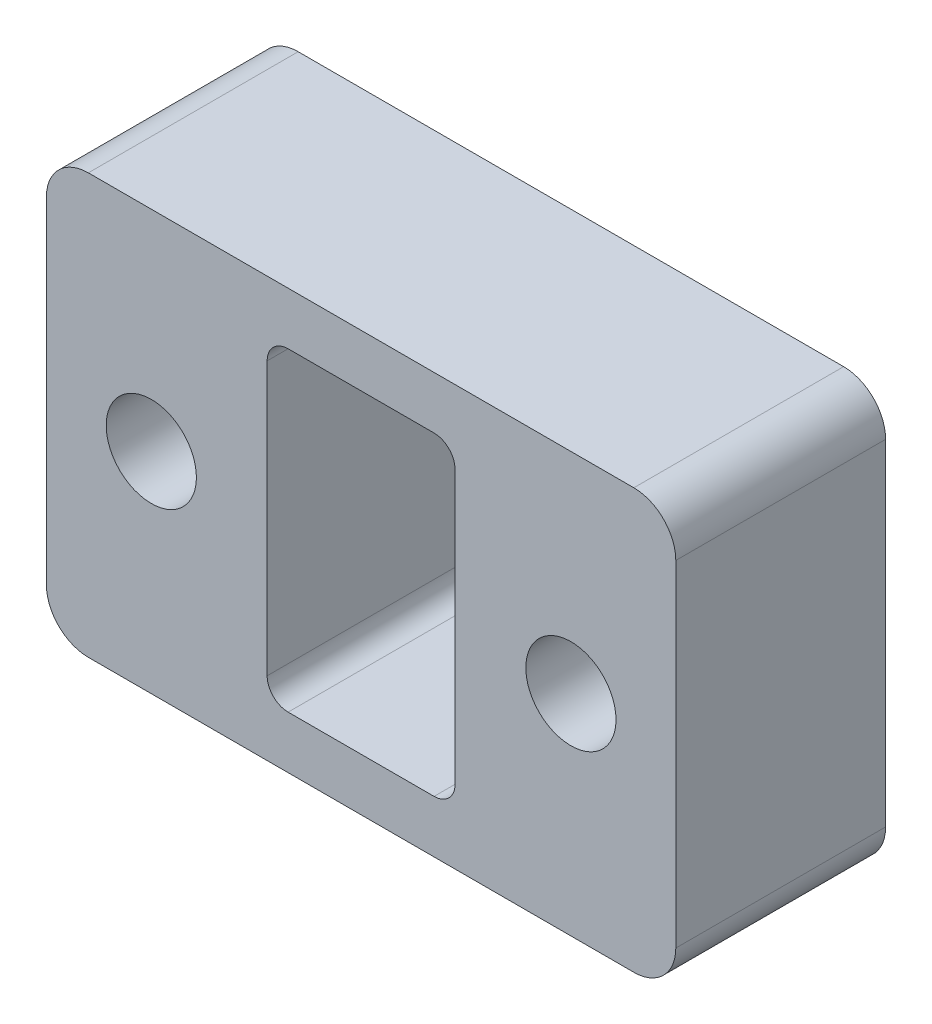
ISO-10303-21;
HEADER;
FILE_DESCRIPTION(('STEP AP214'),'2;1');
FILE_NAME('part.step','',(''),(''),'','','');
FILE_SCHEMA(('AUTOMOTIVE_DESIGN { 1 0 10303 214 1 1 1 1 }'));
ENDSEC;
DATA;
#1=APPLICATION_CONTEXT('core data for automotive mechanical design processes');
#2=APPLICATION_PROTOCOL_DEFINITION('international standard','automotive_design',2000,#1);
#3=PRODUCT_CONTEXT('',#1,'mechanical');
#4=PRODUCT('Part','Part','',(#3));
#5=PRODUCT_RELATED_PRODUCT_CATEGORY('part','',(#4));
#6=PRODUCT_DEFINITION_FORMATION('','',#4);
#7=PRODUCT_DEFINITION_CONTEXT('part definition',#1,'design');
#8=PRODUCT_DEFINITION('design','',#6,#7);
#9=PRODUCT_DEFINITION_SHAPE('','',#8);
#10=(LENGTH_UNIT() NAMED_UNIT(*) SI_UNIT(.MILLI.,.METRE.));
#11=(NAMED_UNIT(*) PLANE_ANGLE_UNIT() SI_UNIT($,.RADIAN.));
#12=(NAMED_UNIT(*) SI_UNIT($,.STERADIAN.) SOLID_ANGLE_UNIT());
#13=UNCERTAINTY_MEASURE_WITH_UNIT(LENGTH_MEASURE(1.E-05),#10,'distance_accuracy_value','');
#14=(GEOMETRIC_REPRESENTATION_CONTEXT(3) GLOBAL_UNCERTAINTY_ASSIGNED_CONTEXT((#13)) GLOBAL_UNIT_ASSIGNED_CONTEXT((#10,
#11,#12)) REPRESENTATION_CONTEXT('',''));
#15=CARTESIAN_POINT('',(0.,0.,0.));
#16=DIRECTION('',(0.,0.,1.));
#17=DIRECTION('',(1.,0.,0.));
#18=AXIS2_PLACEMENT_3D('',#15,#16,#17);
#19=CARTESIAN_POINT('',(0.,0.,10.));
#20=DIRECTION('',(0.,0.,-1.));
#21=DIRECTION('',(-1.,0.,0.));
#22=AXIS2_PLACEMENT_3D('',#19,#20,#21);
#23=PLANE('',#22);
#24=CARTESIAN_POINT('',(9.99999999999999,0.,10.));
#25=DIRECTION('',(0.,0.,1.));
#26=DIRECTION('',(1.,0.,0.));
#27=AXIS2_PLACEMENT_3D('',#24,#25,#26);
#28=CIRCLE('',#27,2.15);
#29=CARTESIAN_POINT('',(12.15,0.,10.));
#30=VERTEX_POINT('',#29);
#31=EDGE_CURVE('E270',#30,#30,#28,.T.);
#32=ORIENTED_EDGE('',*,*,#31,.F.);
#33=EDGE_LOOP('',(#32));
#34=FACE_BOUND('',#33,.T.);
#35=CARTESIAN_POINT('',(-10.,0.,10.));
#36=DIRECTION('',(0.,0.,1.));
#37=DIRECTION('',(1.,0.,0.));
#38=AXIS2_PLACEMENT_3D('',#35,#36,#37);
#39=CIRCLE('',#38,2.15);
#40=CARTESIAN_POINT('',(-7.85,0.,10.));
#41=VERTEX_POINT('',#40);
#42=EDGE_CURVE('E259',#41,#41,#39,.T.);
#43=ORIENTED_EDGE('',*,*,#42,.F.);
#44=EDGE_LOOP('',(#43));
#45=FACE_BOUND('',#44,.T.);
#46=DIRECTION('',(1.,0.,0.));
#47=VECTOR('',#46,1.);
#48=CARTESIAN_POINT('',(-15.,-9.99999999999999,10.));
#49=LINE('',#48,#47);
#50=CARTESIAN_POINT('',(-13.,-9.99999999999999,10.));
#51=VERTEX_POINT('',#50);
#52=CARTESIAN_POINT('',(13.,-9.99999999999999,10.));
#53=VERTEX_POINT('',#52);
#54=EDGE_CURVE('E175',#51,#53,#49,.T.);
#55=ORIENTED_EDGE('',*,*,#54,.T.);
#56=CARTESIAN_POINT('',(13.,-7.99999999999999,10.));
#57=DIRECTION('',(0.,0.,-1.));
#58=DIRECTION('',(-1.,0.,0.));
#59=AXIS2_PLACEMENT_3D('',#56,#57,#58);
#60=CIRCLE('',#59,2.);
#61=CARTESIAN_POINT('',(15.,-7.99999999999999,10.));
#62=VERTEX_POINT('',#61);
#63=EDGE_CURVE('E234',#53,#62,#60,.F.);
#64=ORIENTED_EDGE('',*,*,#63,.T.);
#65=DIRECTION('',(0.,1.,0.));
#66=VECTOR('',#65,1.);
#67=CARTESIAN_POINT('',(15.,-9.99999999999999,10.));
#68=LINE('',#67,#66);
#69=CARTESIAN_POINT('',(15.,8.00000000000001,10.));
#70=VERTEX_POINT('',#69);
#71=EDGE_CURVE('E264',#62,#70,#68,.T.);
#72=ORIENTED_EDGE('',*,*,#71,.T.);
#73=CARTESIAN_POINT('',(13.,8.00000000000001,10.));
#74=DIRECTION('',(0.,0.,-1.));
#75=DIRECTION('',(-1.,0.,0.));
#76=AXIS2_PLACEMENT_3D('',#73,#74,#75);
#77=CIRCLE('',#76,2.);
#78=CARTESIAN_POINT('',(13.,10.,10.));
#79=VERTEX_POINT('',#78);
#80=EDGE_CURVE('E229',#70,#79,#77,.F.);
#81=ORIENTED_EDGE('',*,*,#80,.T.);
#82=DIRECTION('',(-1.,0.,0.));
#83=VECTOR('',#82,1.);
#84=CARTESIAN_POINT('',(-15.,10.,10.));
#85=LINE('',#84,#83);
#86=CARTESIAN_POINT('',(-13.,10.,10.));
#87=VERTEX_POINT('',#86);
#88=EDGE_CURVE('E248',#79,#87,#85,.T.);
#89=ORIENTED_EDGE('',*,*,#88,.T.);
#90=CARTESIAN_POINT('',(-13.,8.00000000000001,10.));
#91=DIRECTION('',(0.,0.,-1.));
#92=DIRECTION('',(-1.,0.,0.));
#93=AXIS2_PLACEMENT_3D('',#90,#91,#92);
#94=CIRCLE('',#93,2.);
#95=CARTESIAN_POINT('',(-15.,8.00000000000001,10.));
#96=VERTEX_POINT('',#95);
#97=EDGE_CURVE('E57',#87,#96,#94,.F.);
#98=ORIENTED_EDGE('',*,*,#97,.T.);
#99=DIRECTION('',(0.,-1.,0.));
#100=VECTOR('',#99,1.);
#101=CARTESIAN_POINT('',(-15.,-9.99999999999999,10.));
#102=LINE('',#101,#100);
#103=CARTESIAN_POINT('',(-15.,-7.99999999999999,10.));
#104=VERTEX_POINT('',#103);
#105=EDGE_CURVE('E180',#96,#104,#102,.T.);
#106=ORIENTED_EDGE('',*,*,#105,.T.);
#107=CARTESIAN_POINT('',(-13.,-7.99999999999999,10.));
#108=DIRECTION('',(0.,0.,-1.));
#109=DIRECTION('',(-1.,0.,0.));
#110=AXIS2_PLACEMENT_3D('',#107,#108,#109);
#111=CIRCLE('',#110,2.);
#112=EDGE_CURVE('E232',#104,#51,#111,.F.);
#113=ORIENTED_EDGE('',*,*,#112,.T.);
#114=EDGE_LOOP('',(#55,#64,#72,#81,#89,#98,#106,#113));
#115=FACE_BOUND('',#114,.T.);
#116=DIRECTION('',(0.,1.,0.));
#117=VECTOR('',#116,1.);
#118=CARTESIAN_POINT('',(4.47816335794328,-7.5,10.));
#119=LINE('',#118,#117);
#120=CARTESIAN_POINT('',(4.47816335794328,-6.5,10.));
#121=VERTEX_POINT('',#120);
#122=CARTESIAN_POINT('',(4.47816335794328,6.50000000000001,10.));
#123=VERTEX_POINT('',#122);
#124=EDGE_CURVE('E280',#121,#123,#119,.T.);
#125=ORIENTED_EDGE('',*,*,#124,.F.);
#126=CARTESIAN_POINT('',(3.47816335794328,-6.5,10.));
#127=DIRECTION('',(0.,0.,-1.));
#128=DIRECTION('',(-1.,0.,0.));
#129=AXIS2_PLACEMENT_3D('',#126,#127,#128);
#130=CIRCLE('',#129,1.);
#131=CARTESIAN_POINT('',(3.47816335794328,-7.5,10.));
#132=VERTEX_POINT('',#131);
#133=EDGE_CURVE('E160',#121,#132,#130,.T.);
#134=ORIENTED_EDGE('',*,*,#133,.T.);
#135=DIRECTION('',(1.,0.,0.));
#136=VECTOR('',#135,1.);
#137=CARTESIAN_POINT('',(-4.47816335794328,-7.5,10.));
#138=LINE('',#137,#136);
#139=CARTESIAN_POINT('',(-3.47816335794328,-7.5,10.));
#140=VERTEX_POINT('',#139);
#141=EDGE_CURVE('E276',#140,#132,#138,.T.);
#142=ORIENTED_EDGE('',*,*,#141,.F.);
#143=CARTESIAN_POINT('',(-3.47816335794328,-6.5,10.));
#144=DIRECTION('',(0.,0.,-1.));
#145=DIRECTION('',(-1.,0.,0.));
#146=AXIS2_PLACEMENT_3D('',#143,#144,#145);
#147=CIRCLE('',#146,1.);
#148=CARTESIAN_POINT('',(-4.47816335794328,-6.5,10.));
#149=VERTEX_POINT('',#148);
#150=EDGE_CURVE('E161',#140,#149,#147,.T.);
#151=ORIENTED_EDGE('',*,*,#150,.T.);
#152=DIRECTION('',(0.,-1.,0.));
#153=VECTOR('',#152,1.);
#154=CARTESIAN_POINT('',(-4.47816335794328,-7.5,10.));
#155=LINE('',#154,#153);
#156=CARTESIAN_POINT('',(-4.47816335794328,6.50000000000001,10.));
#157=VERTEX_POINT('',#156);
#158=EDGE_CURVE('E287',#157,#149,#155,.T.);
#159=ORIENTED_EDGE('',*,*,#158,.F.);
#160=CARTESIAN_POINT('',(-3.47816335794328,6.50000000000001,10.));
#161=DIRECTION('',(0.,0.,-1.));
#162=DIRECTION('',(-1.,0.,0.));
#163=AXIS2_PLACEMENT_3D('',#160,#161,#162);
#164=CIRCLE('',#163,1.);
#165=CARTESIAN_POINT('',(-3.47816335794328,7.50000000000001,10.));
#166=VERTEX_POINT('',#165);
#167=EDGE_CURVE('E209',#157,#166,#164,.T.);
#168=ORIENTED_EDGE('',*,*,#167,.T.);
#169=DIRECTION('',(-1.,0.,0.));
#170=VECTOR('',#169,1.);
#171=CARTESIAN_POINT('',(-4.47816335794328,7.50000000000001,10.));
#172=LINE('',#171,#170);
#173=CARTESIAN_POINT('',(3.47816335794328,7.50000000000001,10.));
#174=VERTEX_POINT('',#173);
#175=EDGE_CURVE('E290',#174,#166,#172,.T.);
#176=ORIENTED_EDGE('',*,*,#175,.F.);
#177=CARTESIAN_POINT('',(3.47816335794328,6.50000000000001,10.));
#178=DIRECTION('',(0.,0.,-1.));
#179=DIRECTION('',(-1.,0.,0.));
#180=AXIS2_PLACEMENT_3D('',#177,#178,#179);
#181=CIRCLE('',#180,1.);
#182=EDGE_CURVE('E201',#174,#123,#181,.T.);
#183=ORIENTED_EDGE('',*,*,#182,.T.);
#184=EDGE_LOOP('',(#125,#134,#142,#151,#159,#168,#176,#183));
#185=FACE_BOUND('',#184,.T.);
#186=ADVANCED_FACE('F35',(#34,#45,#115,#185),#23,.F.);
#187=CARTESIAN_POINT('',(0.,0.,0.));
#188=DIRECTION('',(0.,0.,-1.));
#189=DIRECTION('',(-1.,0.,0.));
#190=AXIS2_PLACEMENT_3D('',#187,#188,#189);
#191=PLANE('',#190);
#192=CARTESIAN_POINT('',(-10.,0.,0.));
#193=DIRECTION('',(0.,0.,1.));
#194=DIRECTION('',(1.,0.,0.));
#195=AXIS2_PLACEMENT_3D('',#192,#193,#194);
#196=CIRCLE('',#195,2.15);
#197=CARTESIAN_POINT('',(-7.85,0.,0.));
#198=VERTEX_POINT('',#197);
#199=EDGE_CURVE('E267',#198,#198,#196,.T.);
#200=ORIENTED_EDGE('',*,*,#199,.T.);
#201=EDGE_LOOP('',(#200));
#202=FACE_BOUND('',#201,.T.);
#203=DIRECTION('',(0.,1.,0.));
#204=VECTOR('',#203,1.);
#205=CARTESIAN_POINT('',(15.,-9.99999999999999,0.));
#206=LINE('',#205,#204);
#207=CARTESIAN_POINT('',(15.,-7.99999999999999,0.));
#208=VERTEX_POINT('',#207);
#209=CARTESIAN_POINT('',(15.,8.00000000000001,0.));
#210=VERTEX_POINT('',#209);
#211=EDGE_CURVE('E257',#208,#210,#206,.T.);
#212=ORIENTED_EDGE('',*,*,#211,.F.);
#213=CARTESIAN_POINT('',(13.,-7.99999999999999,0.));
#214=DIRECTION('',(0.,0.,-1.));
#215=DIRECTION('',(-1.,0.,0.));
#216=AXIS2_PLACEMENT_3D('',#213,#214,#215);
#217=CIRCLE('',#216,2.);
#218=CARTESIAN_POINT('',(13.,-9.99999999999999,0.));
#219=VERTEX_POINT('',#218);
#220=EDGE_CURVE('E222',#208,#219,#217,.T.);
#221=ORIENTED_EDGE('',*,*,#220,.T.);
#222=DIRECTION('',(1.,0.,0.));
#223=VECTOR('',#222,1.);
#224=CARTESIAN_POINT('',(-15.,-9.99999999999999,0.));
#225=LINE('',#224,#223);
#226=CARTESIAN_POINT('',(-13.,-9.99999999999999,0.));
#227=VERTEX_POINT('',#226);
#228=EDGE_CURVE('E183',#227,#219,#225,.T.);
#229=ORIENTED_EDGE('',*,*,#228,.F.);
#230=CARTESIAN_POINT('',(-13.,-7.99999999999999,0.));
#231=DIRECTION('',(0.,0.,-1.));
#232=DIRECTION('',(-1.,0.,0.));
#233=AXIS2_PLACEMENT_3D('',#230,#231,#232);
#234=CIRCLE('',#233,2.);
#235=CARTESIAN_POINT('',(-15.,-7.99999999999999,0.));
#236=VERTEX_POINT('',#235);
#237=EDGE_CURVE('E220',#227,#236,#234,.T.);
#238=ORIENTED_EDGE('',*,*,#237,.T.);
#239=DIRECTION('',(0.,-1.,0.));
#240=VECTOR('',#239,1.);
#241=CARTESIAN_POINT('',(-15.,-9.99999999999999,0.));
#242=LINE('',#241,#240);
#243=CARTESIAN_POINT('',(-15.,8.00000000000001,0.));
#244=VERTEX_POINT('',#243);
#245=EDGE_CURVE('E256',#244,#236,#242,.T.);
#246=ORIENTED_EDGE('',*,*,#245,.F.);
#247=CARTESIAN_POINT('',(-13.,8.00000000000001,0.));
#248=DIRECTION('',(0.,0.,-1.));
#249=DIRECTION('',(-1.,0.,0.));
#250=AXIS2_PLACEMENT_3D('',#247,#248,#249);
#251=CIRCLE('',#250,2.);
#252=CARTESIAN_POINT('',(-13.,10.,0.));
#253=VERTEX_POINT('',#252);
#254=EDGE_CURVE('E218',#244,#253,#251,.T.);
#255=ORIENTED_EDGE('',*,*,#254,.T.);
#256=DIRECTION('',(-1.,0.,0.));
#257=VECTOR('',#256,1.);
#258=CARTESIAN_POINT('',(-15.,10.,0.));
#259=LINE('',#258,#257);
#260=CARTESIAN_POINT('',(13.,10.,0.));
#261=VERTEX_POINT('',#260);
#262=EDGE_CURVE('E246',#261,#253,#259,.T.);
#263=ORIENTED_EDGE('',*,*,#262,.F.);
#264=CARTESIAN_POINT('',(13.,8.00000000000001,0.));
#265=DIRECTION('',(0.,0.,-1.));
#266=DIRECTION('',(-1.,0.,0.));
#267=AXIS2_PLACEMENT_3D('',#264,#265,#266);
#268=CIRCLE('',#267,2.);
#269=EDGE_CURVE('E216',#261,#210,#268,.T.);
#270=ORIENTED_EDGE('',*,*,#269,.T.);
#271=EDGE_LOOP('',(#212,#221,#229,#238,#246,#255,#263,#270));
#272=FACE_BOUND('',#271,.T.);
#273=CARTESIAN_POINT('',(9.99999999999999,0.,0.));
#274=DIRECTION('',(0.,0.,1.));
#275=DIRECTION('',(1.,0.,0.));
#276=AXIS2_PLACEMENT_3D('',#273,#274,#275);
#277=CIRCLE('',#276,2.15);
#278=CARTESIAN_POINT('',(12.15,0.,0.));
#279=VERTEX_POINT('',#278);
#280=EDGE_CURVE('E273',#279,#279,#277,.T.);
#281=ORIENTED_EDGE('',*,*,#280,.T.);
#282=EDGE_LOOP('',(#281));
#283=FACE_BOUND('',#282,.T.);
#284=DIRECTION('',(0.,-1.,0.));
#285=VECTOR('',#284,1.);
#286=CARTESIAN_POINT('',(-4.47816335794328,-7.5,0.));
#287=LINE('',#286,#285);
#288=CARTESIAN_POINT('',(-4.47816335794328,6.50000000000001,0.));
#289=VERTEX_POINT('',#288);
#290=CARTESIAN_POINT('',(-4.47816335794328,-6.5,0.));
#291=VERTEX_POINT('',#290);
#292=EDGE_CURVE('E281',#289,#291,#287,.T.);
#293=ORIENTED_EDGE('',*,*,#292,.T.);
#294=CARTESIAN_POINT('',(-3.47816335794328,-6.5,0.));
#295=DIRECTION('',(0.,0.,-1.));
#296=DIRECTION('',(-1.,0.,0.));
#297=AXIS2_PLACEMENT_3D('',#294,#295,#296);
#298=CIRCLE('',#297,1.);
#299=CARTESIAN_POINT('',(-3.47816335794328,-7.5,0.));
#300=VERTEX_POINT('',#299);
#301=EDGE_CURVE('E203',#291,#300,#298,.F.);
#302=ORIENTED_EDGE('',*,*,#301,.T.);
#303=DIRECTION('',(1.,0.,0.));
#304=VECTOR('',#303,1.);
#305=CARTESIAN_POINT('',(-4.47816335794328,-7.5,0.));
#306=LINE('',#305,#304);
#307=CARTESIAN_POINT('',(3.47816335794328,-7.5,0.));
#308=VERTEX_POINT('',#307);
#309=EDGE_CURVE('E155',#300,#308,#306,.T.);
#310=ORIENTED_EDGE('',*,*,#309,.T.);
#311=CARTESIAN_POINT('',(3.47816335794328,-6.5,0.));
#312=DIRECTION('',(0.,0.,-1.));
#313=DIRECTION('',(-1.,0.,0.));
#314=AXIS2_PLACEMENT_3D('',#311,#312,#313);
#315=CIRCLE('',#314,1.);
#316=CARTESIAN_POINT('',(4.47816335794328,-6.5,0.));
#317=VERTEX_POINT('',#316);
#318=EDGE_CURVE('E149',#308,#317,#315,.F.);
#319=ORIENTED_EDGE('',*,*,#318,.T.);
#320=DIRECTION('',(0.,1.,0.));
#321=VECTOR('',#320,1.);
#322=CARTESIAN_POINT('',(4.47816335794328,-7.5,0.));
#323=LINE('',#322,#321);
#324=CARTESIAN_POINT('',(4.47816335794328,6.50000000000001,0.));
#325=VERTEX_POINT('',#324);
#326=EDGE_CURVE('E153',#317,#325,#323,.T.);
#327=ORIENTED_EDGE('',*,*,#326,.T.);
#328=CARTESIAN_POINT('',(3.47816335794328,6.50000000000001,0.));
#329=DIRECTION('',(0.,0.,-1.));
#330=DIRECTION('',(-1.,0.,0.));
#331=AXIS2_PLACEMENT_3D('',#328,#329,#330);
#332=CIRCLE('',#331,1.);
#333=CARTESIAN_POINT('',(3.47816335794328,7.50000000000001,0.));
#334=VERTEX_POINT('',#333);
#335=EDGE_CURVE('E199',#325,#334,#332,.F.);
#336=ORIENTED_EDGE('',*,*,#335,.T.);
#337=DIRECTION('',(-1.,0.,0.));
#338=VECTOR('',#337,1.);
#339=CARTESIAN_POINT('',(-4.47816335794328,7.50000000000001,0.));
#340=LINE('',#339,#338);
#341=CARTESIAN_POINT('',(-3.47816335794328,7.50000000000001,0.));
#342=VERTEX_POINT('',#341);
#343=EDGE_CURVE('E171',#334,#342,#340,.T.);
#344=ORIENTED_EDGE('',*,*,#343,.T.);
#345=CARTESIAN_POINT('',(-3.47816335794328,6.50000000000001,0.));
#346=DIRECTION('',(0.,0.,-1.));
#347=DIRECTION('',(-1.,0.,0.));
#348=AXIS2_PLACEMENT_3D('',#345,#346,#347);
#349=CIRCLE('',#348,1.);
#350=EDGE_CURVE('E207',#342,#289,#349,.F.);
#351=ORIENTED_EDGE('',*,*,#350,.T.);
#352=EDGE_LOOP('',(#293,#302,#310,#319,#327,#336,#344,#351));
#353=FACE_BOUND('',#352,.T.);
#354=ADVANCED_FACE('F152',(#202,#272,#283,#353),#191,.T.);
#355=CARTESIAN_POINT('',(15.,-9.99999999999999,10.));
#356=DIRECTION('',(-1.,0.,0.));
#357=DIRECTION('',(0.,0.,1.));
#358=AXIS2_PLACEMENT_3D('',#355,#356,#357);
#359=PLANE('',#358);
#360=ORIENTED_EDGE('',*,*,#71,.F.);
#361=DIRECTION('',(0.,0.,-1.));
#362=VECTOR('',#361,1.);
#363=CARTESIAN_POINT('',(15.,-7.99999999999999,10.));
#364=LINE('',#363,#362);
#365=EDGE_CURVE('E213',#62,#208,#364,.T.);
#366=ORIENTED_EDGE('',*,*,#365,.T.);
#367=ORIENTED_EDGE('',*,*,#211,.T.);
#368=DIRECTION('',(0.,0.,-1.));
#369=VECTOR('',#368,1.);
#370=CARTESIAN_POINT('',(15.,8.00000000000001,10.));
#371=LINE('',#370,#369);
#372=EDGE_CURVE('E211',#210,#70,#371,.F.);
#373=ORIENTED_EDGE('',*,*,#372,.T.);
#374=EDGE_LOOP('',(#360,#366,#367,#373));
#375=FACE_BOUND('',#374,.T.);
#376=ADVANCED_FACE('F325',(#375),#359,.F.);
#377=CARTESIAN_POINT('',(-15.,10.,10.));
#378=DIRECTION('',(0.,-1.,0.));
#379=DIRECTION('',(1.,0.,0.));
#380=AXIS2_PLACEMENT_3D('',#377,#378,#379);
#381=PLANE('',#380);
#382=ORIENTED_EDGE('',*,*,#262,.T.);
#383=DIRECTION('',(0.,0.,-1.));
#384=VECTOR('',#383,1.);
#385=CARTESIAN_POINT('',(-13.,10.,10.));
#386=LINE('',#385,#384);
#387=EDGE_CURVE('E11',#253,#87,#386,.F.);
#388=ORIENTED_EDGE('',*,*,#387,.T.);
#389=ORIENTED_EDGE('',*,*,#88,.F.);
#390=DIRECTION('',(0.,0.,-1.));
#391=VECTOR('',#390,1.);
#392=CARTESIAN_POINT('',(13.,10.,10.));
#393=LINE('',#392,#391);
#394=EDGE_CURVE('E43',#79,#261,#393,.T.);
#395=ORIENTED_EDGE('',*,*,#394,.T.);
#396=EDGE_LOOP('',(#382,#388,#389,#395));
#397=FACE_BOUND('',#396,.T.);
#398=ADVANCED_FACE('F245',(#397),#381,.F.);
#399=CARTESIAN_POINT('',(-15.,-9.99999999999999,10.));
#400=DIRECTION('',(1.,0.,0.));
#401=DIRECTION('',(0.,0.,-1.));
#402=AXIS2_PLACEMENT_3D('',#399,#400,#401);
#403=PLANE('',#402);
#404=ORIENTED_EDGE('',*,*,#245,.T.);
#405=DIRECTION('',(0.,0.,-1.));
#406=VECTOR('',#405,1.);
#407=CARTESIAN_POINT('',(-15.,-7.99999999999999,10.));
#408=LINE('',#407,#406);
#409=EDGE_CURVE('E50',#236,#104,#408,.F.);
#410=ORIENTED_EDGE('',*,*,#409,.T.);
#411=ORIENTED_EDGE('',*,*,#105,.F.);
#412=DIRECTION('',(0.,0.,-1.));
#413=VECTOR('',#412,1.);
#414=CARTESIAN_POINT('',(-15.,8.00000000000001,10.));
#415=LINE('',#414,#413);
#416=EDGE_CURVE('E236',#96,#244,#415,.T.);
#417=ORIENTED_EDGE('',*,*,#416,.T.);
#418=EDGE_LOOP('',(#404,#410,#411,#417));
#419=FACE_BOUND('',#418,.T.);
#420=ADVANCED_FACE('F337',(#419),#403,.F.);
#421=CARTESIAN_POINT('',(-15.,-9.99999999999999,10.));
#422=DIRECTION('',(0.,1.,0.));
#423=DIRECTION('',(0.,0.,1.));
#424=AXIS2_PLACEMENT_3D('',#421,#422,#423);
#425=PLANE('',#424);
#426=ORIENTED_EDGE('',*,*,#228,.T.);
#427=DIRECTION('',(0.,0.,-1.));
#428=VECTOR('',#427,1.);
#429=CARTESIAN_POINT('',(13.,-9.99999999999999,10.));
#430=LINE('',#429,#428);
#431=EDGE_CURVE('E227',#219,#53,#430,.F.);
#432=ORIENTED_EDGE('',*,*,#431,.T.);
#433=ORIENTED_EDGE('',*,*,#54,.F.);
#434=DIRECTION('',(0.,0.,-1.));
#435=VECTOR('',#434,1.);
#436=CARTESIAN_POINT('',(-13.,-9.99999999999999,10.));
#437=LINE('',#436,#435);
#438=EDGE_CURVE('E224',#51,#227,#437,.T.);
#439=ORIENTED_EDGE('',*,*,#438,.T.);
#440=EDGE_LOOP('',(#426,#432,#433,#439));
#441=FACE_BOUND('',#440,.T.);
#442=ADVANCED_FACE('F334',(#441),#425,.F.);
#443=CARTESIAN_POINT('',(-10.,0.,10.));
#444=DIRECTION('',(0.,0.,-1.));
#445=DIRECTION('',(-1.,0.,0.));
#446=AXIS2_PLACEMENT_3D('',#443,#444,#445);
#447=CYLINDRICAL_SURFACE('',#446,2.15);
#448=ORIENTED_EDGE('',*,*,#42,.T.);
#449=EDGE_LOOP('',(#448));
#450=FACE_BOUND('',#449,.T.);
#451=ORIENTED_EDGE('',*,*,#199,.F.);
#452=EDGE_LOOP('',(#451));
#453=FACE_BOUND('',#452,.T.);
#454=ADVANCED_FACE('F331',(#450,#453),#447,.F.);
#455=CARTESIAN_POINT('',(9.99999999999999,0.,10.));
#456=DIRECTION('',(0.,0.,-1.));
#457=DIRECTION('',(-1.,0.,0.));
#458=AXIS2_PLACEMENT_3D('',#455,#456,#457);
#459=CYLINDRICAL_SURFACE('',#458,2.15);
#460=ORIENTED_EDGE('',*,*,#31,.T.);
#461=EDGE_LOOP('',(#460));
#462=FACE_BOUND('',#461,.T.);
#463=ORIENTED_EDGE('',*,*,#280,.F.);
#464=EDGE_LOOP('',(#463));
#465=FACE_BOUND('',#464,.T.);
#466=ADVANCED_FACE('F489',(#462,#465),#459,.F.);
#467=CARTESIAN_POINT('',(4.47816335794328,-7.5,10.));
#468=DIRECTION('',(-1.,0.,0.));
#469=DIRECTION('',(0.,0.,1.));
#470=AXIS2_PLACEMENT_3D('',#467,#468,#469);
#471=PLANE('',#470);
#472=ORIENTED_EDGE('',*,*,#124,.T.);
#473=DIRECTION('',(0.,0.,-1.));
#474=VECTOR('',#473,1.);
#475=CARTESIAN_POINT('',(4.47816335794328,6.50000000000001,0.));
#476=LINE('',#475,#474);
#477=EDGE_CURVE('E170',#123,#325,#476,.T.);
#478=ORIENTED_EDGE('',*,*,#477,.T.);
#479=ORIENTED_EDGE('',*,*,#326,.F.);
#480=DIRECTION('',(0.,0.,-1.));
#481=VECTOR('',#480,1.);
#482=CARTESIAN_POINT('',(4.47816335794328,-6.5,10.));
#483=LINE('',#482,#481);
#484=EDGE_CURVE('E167',#317,#121,#483,.F.);
#485=ORIENTED_EDGE('',*,*,#484,.T.);
#486=EDGE_LOOP('',(#472,#478,#479,#485));
#487=FACE_BOUND('',#486,.T.);
#488=ADVANCED_FACE('F166',(#487),#471,.T.);
#489=CARTESIAN_POINT('',(-4.47816335794328,7.50000000000001,10.));
#490=DIRECTION('',(0.,-1.,0.));
#491=DIRECTION('',(0.,0.,-1.));
#492=AXIS2_PLACEMENT_3D('',#489,#490,#491);
#493=PLANE('',#492);
#494=ORIENTED_EDGE('',*,*,#343,.F.);
#495=DIRECTION('',(0.,0.,-1.));
#496=VECTOR('',#495,1.);
#497=CARTESIAN_POINT('',(3.47816335794328,7.50000000000001,10.));
#498=LINE('',#497,#496);
#499=EDGE_CURVE('E188',#334,#174,#498,.F.);
#500=ORIENTED_EDGE('',*,*,#499,.T.);
#501=ORIENTED_EDGE('',*,*,#175,.T.);
#502=DIRECTION('',(0.,0.,-1.));
#503=VECTOR('',#502,1.);
#504=CARTESIAN_POINT('',(-3.47816335794328,7.50000000000001,0.));
#505=LINE('',#504,#503);
#506=EDGE_CURVE('E177',#166,#342,#505,.T.);
#507=ORIENTED_EDGE('',*,*,#506,.T.);
#508=EDGE_LOOP('',(#494,#500,#501,#507));
#509=FACE_BOUND('',#508,.T.);
#510=ADVANCED_FACE('F300',(#509),#493,.T.);
#511=CARTESIAN_POINT('',(-4.47816335794328,-7.5,10.));
#512=DIRECTION('',(1.,0.,0.));
#513=DIRECTION('',(0.,1.,0.));
#514=AXIS2_PLACEMENT_3D('',#511,#512,#513);
#515=PLANE('',#514);
#516=ORIENTED_EDGE('',*,*,#158,.T.);
#517=DIRECTION('',(0.,0.,-1.));
#518=VECTOR('',#517,1.);
#519=CARTESIAN_POINT('',(-4.47816335794328,-6.5,0.));
#520=LINE('',#519,#518);
#521=EDGE_CURVE('E192',#149,#291,#520,.T.);
#522=ORIENTED_EDGE('',*,*,#521,.T.);
#523=ORIENTED_EDGE('',*,*,#292,.F.);
#524=DIRECTION('',(0.,0.,-1.));
#525=VECTOR('',#524,1.);
#526=CARTESIAN_POINT('',(-4.47816335794328,6.50000000000001,10.));
#527=LINE('',#526,#525);
#528=EDGE_CURVE('E190',#289,#157,#527,.F.);
#529=ORIENTED_EDGE('',*,*,#528,.T.);
#530=EDGE_LOOP('',(#516,#522,#523,#529));
#531=FACE_BOUND('',#530,.T.);
#532=ADVANCED_FACE('F309',(#531),#515,.T.);
#533=CARTESIAN_POINT('',(-4.47816335794328,-7.5,10.));
#534=DIRECTION('',(0.,1.,0.));
#535=DIRECTION('',(0.,0.,1.));
#536=AXIS2_PLACEMENT_3D('',#533,#534,#535);
#537=PLANE('',#536);
#538=ORIENTED_EDGE('',*,*,#309,.F.);
#539=DIRECTION('',(0.,0.,-1.));
#540=VECTOR('',#539,1.);
#541=CARTESIAN_POINT('',(-3.47816335794328,-7.5,10.));
#542=LINE('',#541,#540);
#543=EDGE_CURVE('E197',#300,#140,#542,.F.);
#544=ORIENTED_EDGE('',*,*,#543,.T.);
#545=ORIENTED_EDGE('',*,*,#141,.T.);
#546=DIRECTION('',(0.,0.,-1.));
#547=VECTOR('',#546,1.);
#548=CARTESIAN_POINT('',(3.47816335794328,-7.5,0.));
#549=LINE('',#548,#547);
#550=EDGE_CURVE('E195',#132,#308,#549,.T.);
#551=ORIENTED_EDGE('',*,*,#550,.T.);
#552=EDGE_LOOP('',(#538,#544,#545,#551));
#553=FACE_BOUND('',#552,.T.);
#554=ADVANCED_FACE('F317',(#553),#537,.T.);
#555=CARTESIAN_POINT('',(3.47816335794328,6.50000000000001,10.));
#556=DIRECTION('',(0.,0.,1.));
#557=DIRECTION('',(1.,0.,0.));
#558=AXIS2_PLACEMENT_3D('',#555,#556,#557);
#559=CYLINDRICAL_SURFACE('',#558,1.);
#560=ORIENTED_EDGE('',*,*,#182,.F.);
#561=ORIENTED_EDGE('',*,*,#499,.F.);
#562=ORIENTED_EDGE('',*,*,#335,.F.);
#563=ORIENTED_EDGE('',*,*,#477,.F.);
#564=EDGE_LOOP('',(#560,#561,#562,#563));
#565=FACE_BOUND('',#564,.T.);
#566=ADVANCED_FACE('F296',(#565),#559,.F.);
#567=CARTESIAN_POINT('',(-3.47816335794328,-6.5,10.));
#568=DIRECTION('',(0.,0.,1.));
#569=DIRECTION('',(1.,0.,0.));
#570=AXIS2_PLACEMENT_3D('',#567,#568,#569);
#571=CYLINDRICAL_SURFACE('',#570,1.);
#572=ORIENTED_EDGE('',*,*,#150,.F.);
#573=ORIENTED_EDGE('',*,*,#543,.F.);
#574=ORIENTED_EDGE('',*,*,#301,.F.);
#575=ORIENTED_EDGE('',*,*,#521,.F.);
#576=EDGE_LOOP('',(#572,#573,#574,#575));
#577=FACE_BOUND('',#576,.T.);
#578=ADVANCED_FACE('F314',(#577),#571,.F.);
#579=CARTESIAN_POINT('',(3.47816335794328,-6.5,10.));
#580=DIRECTION('',(0.,0.,1.));
#581=DIRECTION('',(1.,0.,0.));
#582=AXIS2_PLACEMENT_3D('',#579,#580,#581);
#583=CYLINDRICAL_SURFACE('',#582,1.);
#584=ORIENTED_EDGE('',*,*,#133,.F.);
#585=ORIENTED_EDGE('',*,*,#484,.F.);
#586=ORIENTED_EDGE('',*,*,#318,.F.);
#587=ORIENTED_EDGE('',*,*,#550,.F.);
#588=EDGE_LOOP('',(#584,#585,#586,#587));
#589=FACE_BOUND('',#588,.T.);
#590=ADVANCED_FACE('F174',(#589),#583,.F.);
#591=CARTESIAN_POINT('',(-3.47816335794328,6.50000000000001,10.));
#592=DIRECTION('',(0.,0.,1.));
#593=DIRECTION('',(1.,0.,0.));
#594=AXIS2_PLACEMENT_3D('',#591,#592,#593);
#595=CYLINDRICAL_SURFACE('',#594,1.);
#596=ORIENTED_EDGE('',*,*,#167,.F.);
#597=ORIENTED_EDGE('',*,*,#528,.F.);
#598=ORIENTED_EDGE('',*,*,#350,.F.);
#599=ORIENTED_EDGE('',*,*,#506,.F.);
#600=EDGE_LOOP('',(#596,#597,#598,#599));
#601=FACE_BOUND('',#600,.T.);
#602=ADVANCED_FACE('F305',(#601),#595,.F.);
#603=CARTESIAN_POINT('',(13.,-7.99999999999999,10.));
#604=DIRECTION('',(0.,0.,-1.));
#605=DIRECTION('',(-1.,0.,0.));
#606=AXIS2_PLACEMENT_3D('',#603,#604,#605);
#607=CYLINDRICAL_SURFACE('',#606,2.);
#608=ORIENTED_EDGE('',*,*,#63,.F.);
#609=ORIENTED_EDGE('',*,*,#431,.F.);
#610=ORIENTED_EDGE('',*,*,#220,.F.);
#611=ORIENTED_EDGE('',*,*,#365,.F.);
#612=EDGE_LOOP('',(#608,#609,#610,#611));
#613=FACE_BOUND('',#612,.T.);
#614=ADVANCED_FACE('F354',(#613),#607,.T.);
#615=CARTESIAN_POINT('',(-13.,-7.99999999999999,10.));
#616=DIRECTION('',(0.,0.,-1.));
#617=DIRECTION('',(-1.,0.,0.));
#618=AXIS2_PLACEMENT_3D('',#615,#616,#617);
#619=CYLINDRICAL_SURFACE('',#618,2.);
#620=ORIENTED_EDGE('',*,*,#112,.F.);
#621=ORIENTED_EDGE('',*,*,#409,.F.);
#622=ORIENTED_EDGE('',*,*,#237,.F.);
#623=ORIENTED_EDGE('',*,*,#438,.F.);
#624=EDGE_LOOP('',(#620,#621,#622,#623));
#625=FACE_BOUND('',#624,.T.);
#626=ADVANCED_FACE('F357',(#625),#619,.T.);
#627=CARTESIAN_POINT('',(-13.,8.00000000000001,10.));
#628=DIRECTION('',(0.,0.,-1.));
#629=DIRECTION('',(-1.,0.,0.));
#630=AXIS2_PLACEMENT_3D('',#627,#628,#629);
#631=CYLINDRICAL_SURFACE('',#630,2.);
#632=ORIENTED_EDGE('',*,*,#97,.F.);
#633=ORIENTED_EDGE('',*,*,#387,.F.);
#634=ORIENTED_EDGE('',*,*,#254,.F.);
#635=ORIENTED_EDGE('',*,*,#416,.F.);
#636=EDGE_LOOP('',(#632,#633,#634,#635));
#637=FACE_BOUND('',#636,.T.);
#638=ADVANCED_FACE('F360',(#637),#631,.T.);
#639=CARTESIAN_POINT('',(13.,8.00000000000001,10.));
#640=DIRECTION('',(0.,0.,-1.));
#641=DIRECTION('',(-1.,0.,0.));
#642=AXIS2_PLACEMENT_3D('',#639,#640,#641);
#643=CYLINDRICAL_SURFACE('',#642,2.);
#644=ORIENTED_EDGE('',*,*,#80,.F.);
#645=ORIENTED_EDGE('',*,*,#372,.F.);
#646=ORIENTED_EDGE('',*,*,#269,.F.);
#647=ORIENTED_EDGE('',*,*,#394,.F.);
#648=EDGE_LOOP('',(#644,#645,#646,#647));
#649=FACE_BOUND('',#648,.T.);
#650=ADVANCED_FACE('F37',(#649),#643,.T.);
#651=CLOSED_SHELL('',(#186,#354,#376,#398,#420,#442,#454,#466,#488,#510,#532,#554,#566,#578,
#590,#602,#614,#626,#638,#650));
#652=MANIFOLD_SOLID_BREP('B2',#651);
#653=ADVANCED_BREP_SHAPE_REPRESENTATION('',(#18,#652),#14);
#654=SHAPE_DEFINITION_REPRESENTATION(#9,#653);
ENDSEC;
END-ISO-10303-21;
